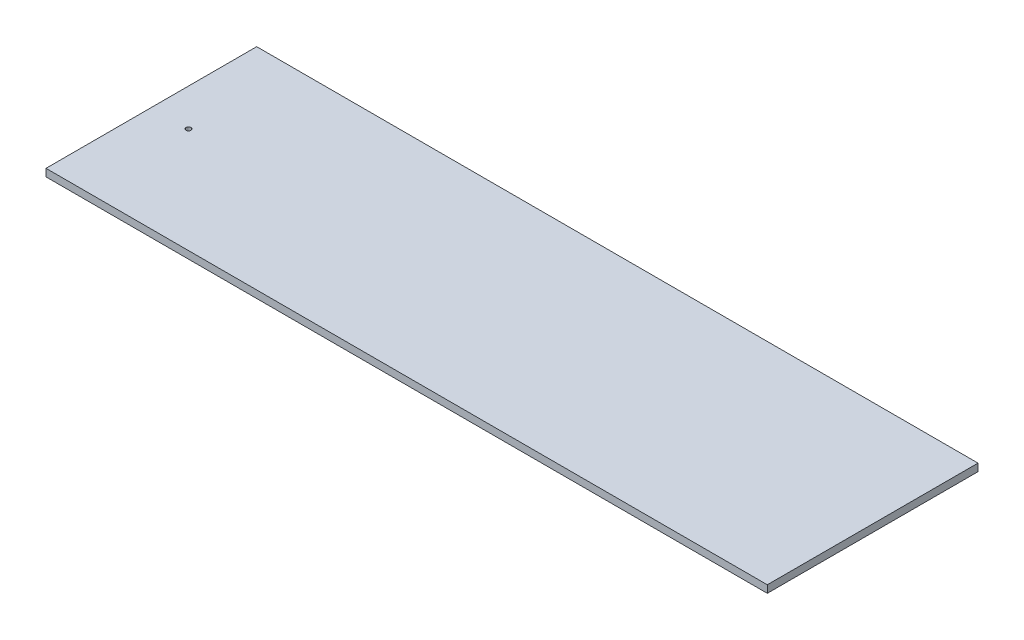
ISO-10303-21;
HEADER;
FILE_DESCRIPTION(('STEP AP214'),'2;1');
FILE_NAME('part.step','',(''),(''),'','','');
FILE_SCHEMA(('AUTOMOTIVE_DESIGN { 1 0 10303 214 1 1 1 1 }'));
ENDSEC;
DATA;
#1=APPLICATION_CONTEXT('core data for automotive mechanical design processes');
#2=APPLICATION_PROTOCOL_DEFINITION('international standard','automotive_design',2000,#1);
#3=PRODUCT_CONTEXT('',#1,'mechanical');
#4=PRODUCT('Part','Part','',(#3));
#5=PRODUCT_RELATED_PRODUCT_CATEGORY('part','',(#4));
#6=PRODUCT_DEFINITION_FORMATION('','',#4);
#7=PRODUCT_DEFINITION_CONTEXT('part definition',#1,'design');
#8=PRODUCT_DEFINITION('design','',#6,#7);
#9=PRODUCT_DEFINITION_SHAPE('','',#8);
#10=(LENGTH_UNIT() NAMED_UNIT(*) SI_UNIT(.MILLI.,.METRE.));
#11=(NAMED_UNIT(*) PLANE_ANGLE_UNIT() SI_UNIT($,.RADIAN.));
#12=(NAMED_UNIT(*) SI_UNIT($,.STERADIAN.) SOLID_ANGLE_UNIT());
#13=UNCERTAINTY_MEASURE_WITH_UNIT(LENGTH_MEASURE(1.E-05),#10,'distance_accuracy_value','');
#14=(GEOMETRIC_REPRESENTATION_CONTEXT(3) GLOBAL_UNCERTAINTY_ASSIGNED_CONTEXT((#13)) GLOBAL_UNIT_ASSIGNED_CONTEXT((#10,
#11,#12)) REPRESENTATION_CONTEXT('',''));
#15=CARTESIAN_POINT('',(0.,0.,0.));
#16=DIRECTION('',(0.,0.,1.));
#17=DIRECTION('',(1.,0.,0.));
#18=AXIS2_PLACEMENT_3D('',#15,#16,#17);
#19=CARTESIAN_POINT('',(145.5,0.,-42.5));
#20=DIRECTION('',(0.,0.,-1.));
#21=DIRECTION('',(-1.,0.,0.));
#22=AXIS2_PLACEMENT_3D('',#19,#20,#21);
#23=PLANE('',#22);
#24=DIRECTION('',(-1.,0.,0.));
#25=VECTOR('',#24,1.);
#26=CARTESIAN_POINT('',(145.5,3.,-42.5));
#27=LINE('',#26,#25);
#28=CARTESIAN_POINT('',(145.5,3.,-42.5));
#29=VERTEX_POINT('',#28);
#30=CARTESIAN_POINT('',(-145.5,3.,-42.5));
#31=VERTEX_POINT('',#30);
#32=EDGE_CURVE('E98',#29,#31,#27,.T.);
#33=ORIENTED_EDGE('',*,*,#32,.F.);
#34=DIRECTION('',(0.,1.,0.));
#35=VECTOR('',#34,1.);
#36=CARTESIAN_POINT('',(145.5,0.,-42.5));
#37=LINE('',#36,#35);
#38=CARTESIAN_POINT('',(145.5,0.,-42.5));
#39=VERTEX_POINT('',#38);
#40=EDGE_CURVE('E11',#39,#29,#37,.T.);
#41=ORIENTED_EDGE('',*,*,#40,.F.);
#42=DIRECTION('',(-1.,0.,0.));
#43=VECTOR('',#42,1.);
#44=CARTESIAN_POINT('',(145.5,0.,-42.5));
#45=LINE('',#44,#43);
#46=CARTESIAN_POINT('',(-145.5,0.,-42.5));
#47=VERTEX_POINT('',#46);
#48=EDGE_CURVE('E91',#39,#47,#45,.T.);
#49=ORIENTED_EDGE('',*,*,#48,.T.);
#50=DIRECTION('',(0.,1.,0.));
#51=VECTOR('',#50,1.);
#52=CARTESIAN_POINT('',(-145.5,0.,-42.5));
#53=LINE('',#52,#51);
#54=EDGE_CURVE('E36',#47,#31,#53,.T.);
#55=ORIENTED_EDGE('',*,*,#54,.T.);
#56=EDGE_LOOP('',(#33,#41,#49,#55));
#57=FACE_BOUND('',#56,.T.);
#58=ADVANCED_FACE('F33',(#57),#23,.T.);
#59=CARTESIAN_POINT('',(145.5,0.,42.5));
#60=DIRECTION('',(1.,0.,0.));
#61=DIRECTION('',(0.,0.,-1.));
#62=AXIS2_PLACEMENT_3D('',#59,#60,#61);
#63=PLANE('',#62);
#64=DIRECTION('',(0.,0.,-1.));
#65=VECTOR('',#64,1.);
#66=CARTESIAN_POINT('',(145.5,3.,42.5));
#67=LINE('',#66,#65);
#68=CARTESIAN_POINT('',(145.5,3.,42.5));
#69=VERTEX_POINT('',#68);
#70=EDGE_CURVE('E93',#69,#29,#67,.T.);
#71=ORIENTED_EDGE('',*,*,#70,.F.);
#72=DIRECTION('',(0.,1.,0.));
#73=VECTOR('',#72,1.);
#74=CARTESIAN_POINT('',(145.5,0.,42.5));
#75=LINE('',#74,#73);
#76=CARTESIAN_POINT('',(145.5,0.,42.5));
#77=VERTEX_POINT('',#76);
#78=EDGE_CURVE('E42',#77,#69,#75,.T.);
#79=ORIENTED_EDGE('',*,*,#78,.F.);
#80=DIRECTION('',(0.,0.,-1.));
#81=VECTOR('',#80,1.);
#82=CARTESIAN_POINT('',(145.5,0.,42.5));
#83=LINE('',#82,#81);
#84=EDGE_CURVE('E88',#77,#39,#83,.T.);
#85=ORIENTED_EDGE('',*,*,#84,.T.);
#86=ORIENTED_EDGE('',*,*,#40,.T.);
#87=EDGE_LOOP('',(#71,#79,#85,#86));
#88=FACE_BOUND('',#87,.T.);
#89=ADVANCED_FACE('F109',(#88),#63,.T.);
#90=CARTESIAN_POINT('',(-145.5,0.,42.5));
#91=DIRECTION('',(0.,0.,1.));
#92=DIRECTION('',(1.,0.,0.));
#93=AXIS2_PLACEMENT_3D('',#90,#91,#92);
#94=PLANE('',#93);
#95=DIRECTION('',(1.,0.,0.));
#96=VECTOR('',#95,1.);
#97=CARTESIAN_POINT('',(-145.5,3.,42.5));
#98=LINE('',#97,#96);
#99=CARTESIAN_POINT('',(-145.5,3.,42.5));
#100=VERTEX_POINT('',#99);
#101=EDGE_CURVE('E83',#100,#69,#98,.T.);
#102=ORIENTED_EDGE('',*,*,#101,.F.);
#103=DIRECTION('',(0.,1.,0.));
#104=VECTOR('',#103,1.);
#105=CARTESIAN_POINT('',(-145.5,0.,42.5));
#106=LINE('',#105,#104);
#107=CARTESIAN_POINT('',(-145.5,0.,42.5));
#108=VERTEX_POINT('',#107);
#109=EDGE_CURVE('E78',#108,#100,#106,.T.);
#110=ORIENTED_EDGE('',*,*,#109,.F.);
#111=DIRECTION('',(1.,0.,0.));
#112=VECTOR('',#111,1.);
#113=CARTESIAN_POINT('',(-145.5,0.,42.5));
#114=LINE('',#113,#112);
#115=EDGE_CURVE('E81',#108,#77,#114,.T.);
#116=ORIENTED_EDGE('',*,*,#115,.T.);
#117=ORIENTED_EDGE('',*,*,#78,.T.);
#118=EDGE_LOOP('',(#102,#110,#116,#117));
#119=FACE_BOUND('',#118,.T.);
#120=ADVANCED_FACE('F80',(#119),#94,.T.);
#121=CARTESIAN_POINT('',(-145.5,0.,-42.5));
#122=DIRECTION('',(-1.,0.,0.));
#123=DIRECTION('',(0.,0.,1.));
#124=AXIS2_PLACEMENT_3D('',#121,#122,#123);
#125=PLANE('',#124);
#126=DIRECTION('',(0.,0.,1.));
#127=VECTOR('',#126,1.);
#128=CARTESIAN_POINT('',(-145.5,3.,-42.5));
#129=LINE('',#128,#127);
#130=EDGE_CURVE('E101',#31,#100,#129,.T.);
#131=ORIENTED_EDGE('',*,*,#130,.F.);
#132=ORIENTED_EDGE('',*,*,#54,.F.);
#133=DIRECTION('',(0.,0.,1.));
#134=VECTOR('',#133,1.);
#135=CARTESIAN_POINT('',(-145.5,0.,-42.5));
#136=LINE('',#135,#134);
#137=EDGE_CURVE('E87',#47,#108,#136,.T.);
#138=ORIENTED_EDGE('',*,*,#137,.T.);
#139=ORIENTED_EDGE('',*,*,#109,.T.);
#140=EDGE_LOOP('',(#131,#132,#138,#139));
#141=FACE_BOUND('',#140,.T.);
#142=ADVANCED_FACE('F90',(#141),#125,.T.);
#143=CARTESIAN_POINT('',(0.,0.,0.));
#144=DIRECTION('',(0.,1.,0.));
#145=DIRECTION('',(0.,0.,1.));
#146=AXIS2_PLACEMENT_3D('',#143,#144,#145);
#147=PLANE('',#146);
#148=CARTESIAN_POINT('',(-130.5,0.,0.));
#149=DIRECTION('',(0.,1.,0.));
#150=DIRECTION('',(0.,0.,-1.));
#151=AXIS2_PLACEMENT_3D('',#148,#149,#150);
#152=CIRCLE('',#151,1.);
#153=CARTESIAN_POINT('',(-130.5,0.,-1.));
#154=VERTEX_POINT('',#153);
#155=EDGE_CURVE('E102',#154,#154,#152,.T.);
#156=ORIENTED_EDGE('',*,*,#155,.T.);
#157=EDGE_LOOP('',(#156));
#158=FACE_BOUND('',#157,.T.);
#159=ORIENTED_EDGE('',*,*,#48,.F.);
#160=ORIENTED_EDGE('',*,*,#84,.F.);
#161=ORIENTED_EDGE('',*,*,#115,.F.);
#162=ORIENTED_EDGE('',*,*,#137,.F.);
#163=EDGE_LOOP('',(#159,#160,#161,#162));
#164=FACE_BOUND('',#163,.T.);
#165=ADVANCED_FACE('F86',(#158,#164),#147,.F.);
#166=CARTESIAN_POINT('',(0.,3.,0.));
#167=DIRECTION('',(0.,1.,0.));
#168=DIRECTION('',(0.,0.,1.));
#169=AXIS2_PLACEMENT_3D('',#166,#167,#168);
#170=PLANE('',#169);
#171=CARTESIAN_POINT('',(-130.5,3.,0.));
#172=DIRECTION('',(0.,1.,0.));
#173=DIRECTION('',(0.,0.,-1.));
#174=AXIS2_PLACEMENT_3D('',#171,#172,#173);
#175=CIRCLE('',#174,1.);
#176=CARTESIAN_POINT('',(-130.5,3.,-1.));
#177=VERTEX_POINT('',#176);
#178=EDGE_CURVE('E139',#177,#177,#175,.T.);
#179=ORIENTED_EDGE('',*,*,#178,.F.);
#180=EDGE_LOOP('',(#179));
#181=FACE_BOUND('',#180,.T.);
#182=ORIENTED_EDGE('',*,*,#32,.T.);
#183=ORIENTED_EDGE('',*,*,#130,.T.);
#184=ORIENTED_EDGE('',*,*,#101,.T.);
#185=ORIENTED_EDGE('',*,*,#70,.T.);
#186=EDGE_LOOP('',(#182,#183,#184,#185));
#187=FACE_BOUND('',#186,.T.);
#188=ADVANCED_FACE('F108',(#181,#187),#170,.T.);
#189=CARTESIAN_POINT('',(-130.5,0.,0.));
#190=DIRECTION('',(0.,1.,0.));
#191=DIRECTION('',(0.,0.,1.));
#192=AXIS2_PLACEMENT_3D('',#189,#190,#191);
#193=CYLINDRICAL_SURFACE('',#192,1.);
#194=ORIENTED_EDGE('',*,*,#155,.F.);
#195=EDGE_LOOP('',(#194));
#196=FACE_BOUND('',#195,.T.);
#197=ORIENTED_EDGE('',*,*,#178,.T.);
#198=EDGE_LOOP('',(#197));
#199=FACE_BOUND('',#198,.T.);
#200=ADVANCED_FACE('F127',(#196,#199),#193,.F.);
#201=CLOSED_SHELL('',(#58,#89,#120,#142,#165,#188,#200));
#202=MANIFOLD_SOLID_BREP('B2',#201);
#203=ADVANCED_BREP_SHAPE_REPRESENTATION('',(#18,#202),#14);
#204=SHAPE_DEFINITION_REPRESENTATION(#9,#203);
ENDSEC;
END-ISO-10303-21;
